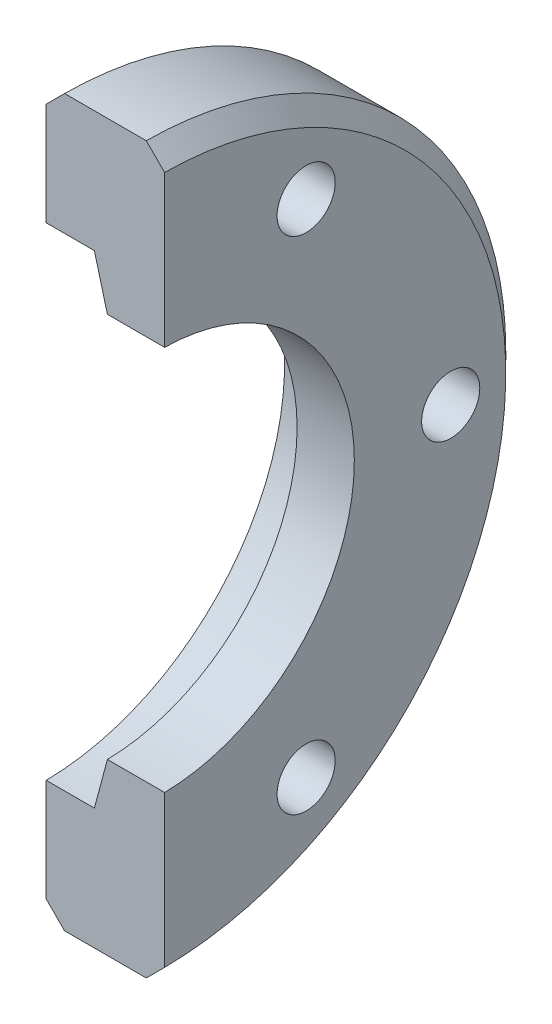
ISO-10303-21;
HEADER;
FILE_DESCRIPTION(('STEP AP214'),'2;1');
FILE_NAME('part.step','',(''),(''),'','','');
FILE_SCHEMA(('AUTOMOTIVE_DESIGN { 1 0 10303 214 1 1 1 1 }'));
ENDSEC;
DATA;
#1=APPLICATION_CONTEXT('core data for automotive mechanical design processes');
#2=APPLICATION_PROTOCOL_DEFINITION('international standard','automotive_design',2000,#1);
#3=PRODUCT_CONTEXT('',#1,'mechanical');
#4=PRODUCT('Part','Part','',(#3));
#5=PRODUCT_RELATED_PRODUCT_CATEGORY('part','',(#4));
#6=PRODUCT_DEFINITION_FORMATION('','',#4);
#7=PRODUCT_DEFINITION_CONTEXT('part definition',#1,'design');
#8=PRODUCT_DEFINITION('design','',#6,#7);
#9=PRODUCT_DEFINITION_SHAPE('','',#8);
#10=(LENGTH_UNIT() NAMED_UNIT(*) SI_UNIT(.MILLI.,.METRE.));
#11=(NAMED_UNIT(*) PLANE_ANGLE_UNIT() SI_UNIT($,.RADIAN.));
#12=(NAMED_UNIT(*) SI_UNIT($,.STERADIAN.) SOLID_ANGLE_UNIT());
#13=UNCERTAINTY_MEASURE_WITH_UNIT(LENGTH_MEASURE(1.E-05),#10,'distance_accuracy_value','');
#14=(GEOMETRIC_REPRESENTATION_CONTEXT(3) GLOBAL_UNCERTAINTY_ASSIGNED_CONTEXT((#13)) GLOBAL_UNIT_ASSIGNED_CONTEXT((#10,
#11,#12)) REPRESENTATION_CONTEXT('',''));
#15=CARTESIAN_POINT('',(0.,0.,0.));
#16=DIRECTION('',(0.,0.,1.));
#17=DIRECTION('',(1.,0.,0.));
#18=AXIS2_PLACEMENT_3D('',#15,#16,#17);
#19=CARTESIAN_POINT('',(0.,20.7872077670378,-12.0015));
#20=DIRECTION('',(1.,0.,0.));
#21=DIRECTION('',(0.,0.,-1.));
#22=AXIS2_PLACEMENT_3D('',#19,#20,#21);
#23=CYLINDRICAL_SURFACE('',#22,2.413);
#24=CARTESIAN_POINT('',(9.8298,20.7872077670378,-12.0015));
#25=DIRECTION('',(-1.,0.,0.));
#26=DIRECTION('',(0.,0.,-1.));
#27=AXIS2_PLACEMENT_3D('',#24,#25,#26);
#28=CIRCLE('',#27,2.413);
#29=CARTESIAN_POINT('',(9.8298,20.7872077670378,-14.4145));
#30=VERTEX_POINT('',#29);
#31=EDGE_CURVE('E147',#30,#30,#28,.T.);
#32=ORIENTED_EDGE('',*,*,#31,.F.);
#33=EDGE_LOOP('',(#32));
#34=FACE_BOUND('',#33,.T.);
#35=CARTESIAN_POINT('',(0.,20.7872077670378,-12.0015));
#36=DIRECTION('',(1.,0.,0.));
#37=DIRECTION('',(0.,0.,-1.));
#38=AXIS2_PLACEMENT_3D('',#35,#36,#37);
#39=CIRCLE('',#38,2.413);
#40=CARTESIAN_POINT('',(0.,20.7872077670378,-14.4145));
#41=VERTEX_POINT('',#40);
#42=EDGE_CURVE('E114',#41,#41,#39,.T.);
#43=ORIENTED_EDGE('',*,*,#42,.F.);
#44=EDGE_LOOP('',(#43));
#45=FACE_BOUND('',#44,.T.);
#46=ADVANCED_FACE('F16',(#34,#45),#23,.F.);
#47=CARTESIAN_POINT('',(9.8298,22.2885,0.));
#48=DIRECTION('',(1.,0.,0.));
#49=DIRECTION('',(0.,1.,0.));
#50=AXIS2_PLACEMENT_3D('',#47,#48,#49);
#51=PLANE('',#50);
#52=DIRECTION('',(0.,-1.,0.));
#53=VECTOR('',#52,1.);
#54=CARTESIAN_POINT('',(9.8298,11.14425,-0.254));
#55=LINE('',#54,#53);
#56=CARTESIAN_POINT('',(9.8298,-15.999983999992,-0.254));
#57=VERTEX_POINT('',#56);
#58=CARTESIAN_POINT('',(9.8298,-28.5738710888113,-0.254));
#59=VERTEX_POINT('',#58);
#60=EDGE_CURVE('E11',#57,#59,#55,.T.);
#61=ORIENTED_EDGE('',*,*,#60,.T.);
#62=CARTESIAN_POINT('',(9.8298,0.,0.));
#63=DIRECTION('',(-1.,0.,0.));
#64=DIRECTION('',(0.,1.,0.));
#65=AXIS2_PLACEMENT_3D('',#62,#63,#64);
#66=CIRCLE('',#65,28.575);
#67=CARTESIAN_POINT('',(9.8298,28.5738710888113,-0.254));
#68=VERTEX_POINT('',#67);
#69=EDGE_CURVE('E35',#68,#59,#66,.T.);
#70=ORIENTED_EDGE('',*,*,#69,.F.);
#71=DIRECTION('',(0.,-1.,0.));
#72=VECTOR('',#71,1.);
#73=CARTESIAN_POINT('',(9.8298,11.14425,-0.254));
#74=LINE('',#73,#72);
#75=CARTESIAN_POINT('',(9.8298,15.999983999992,-0.254));
#76=VERTEX_POINT('',#75);
#77=EDGE_CURVE('E26',#68,#76,#74,.T.);
#78=ORIENTED_EDGE('',*,*,#77,.T.);
#79=CARTESIAN_POINT('',(9.8298,0.,0.));
#80=DIRECTION('',(-1.,0.,0.));
#81=DIRECTION('',(0.,1.,0.));
#82=AXIS2_PLACEMENT_3D('',#79,#80,#81);
#83=CIRCLE('',#82,16.002);
#84=EDGE_CURVE('E154',#76,#57,#83,.T.);
#85=ORIENTED_EDGE('',*,*,#84,.T.);
#86=EDGE_LOOP('',(#61,#70,#78,#85));
#87=FACE_BOUND('',#86,.T.);
#88=CARTESIAN_POINT('',(9.8298,-20.7872077670379,-12.0015));
#89=DIRECTION('',(-1.,0.,0.));
#90=DIRECTION('',(0.,0.,-1.));
#91=AXIS2_PLACEMENT_3D('',#88,#89,#90);
#92=CIRCLE('',#91,2.413);
#93=CARTESIAN_POINT('',(9.8298,-20.7872077670379,-14.4145));
#94=VERTEX_POINT('',#93);
#95=EDGE_CURVE('E151',#94,#94,#92,.T.);
#96=ORIENTED_EDGE('',*,*,#95,.T.);
#97=EDGE_LOOP('',(#96));
#98=FACE_BOUND('',#97,.T.);
#99=CARTESIAN_POINT('',(9.8298,0.,-24.003));
#100=DIRECTION('',(-1.,0.,0.));
#101=DIRECTION('',(0.,0.,-1.));
#102=AXIS2_PLACEMENT_3D('',#99,#100,#101);
#103=CIRCLE('',#102,2.413);
#104=CARTESIAN_POINT('',(9.8298,0.,-26.416));
#105=VERTEX_POINT('',#104);
#106=EDGE_CURVE('E148',#105,#105,#103,.T.);
#107=ORIENTED_EDGE('',*,*,#106,.T.);
#108=EDGE_LOOP('',(#107));
#109=FACE_BOUND('',#108,.T.);
#110=ORIENTED_EDGE('',*,*,#31,.T.);
#111=EDGE_LOOP('',(#110));
#112=FACE_BOUND('',#111,.T.);
#113=ADVANCED_FACE('F163',(#87,#98,#109,#112),#51,.T.);
#114=CARTESIAN_POINT('',(7.4549,0.,0.));
#115=DIRECTION('',(-1.,0.,0.));
#116=DIRECTION('',(0.,1.,0.));
#117=AXIS2_PLACEMENT_3D('',#114,#115,#116);
#118=CYLINDRICAL_SURFACE('',#117,16.002);
#119=DIRECTION('',(1.,0.,0.));
#120=VECTOR('',#119,1.);
#121=CARTESIAN_POINT('',(7.4549,-15.999983999992,-0.254));
#122=LINE('',#121,#120);
#123=CARTESIAN_POINT('',(5.08,-15.999983999992,-0.254));
#124=VERTEX_POINT('',#123);
#125=EDGE_CURVE('E144',#124,#57,#122,.T.);
#126=ORIENTED_EDGE('',*,*,#125,.T.);
#127=ORIENTED_EDGE('',*,*,#84,.F.);
#128=DIRECTION('',(-1.,0.,0.));
#129=VECTOR('',#128,1.);
#130=CARTESIAN_POINT('',(7.4549,15.999983999992,-0.254));
#131=LINE('',#130,#129);
#132=CARTESIAN_POINT('',(5.08,15.999983999992,-0.254));
#133=VERTEX_POINT('',#132);
#134=EDGE_CURVE('E141',#76,#133,#131,.T.);
#135=ORIENTED_EDGE('',*,*,#134,.T.);
#136=CARTESIAN_POINT('',(5.08,0.,0.));
#137=DIRECTION('',(-1.,0.,0.));
#138=DIRECTION('',(0.,1.,0.));
#139=AXIS2_PLACEMENT_3D('',#136,#137,#138);
#140=CIRCLE('',#139,16.002);
#141=EDGE_CURVE('E139',#133,#124,#140,.T.);
#142=ORIENTED_EDGE('',*,*,#141,.T.);
#143=EDGE_LOOP('',(#126,#127,#135,#142));
#144=FACE_BOUND('',#143,.T.);
#145=ADVANCED_FACE('F210',(#144),#118,.F.);
#146=CARTESIAN_POINT('',(4.53893019572384,0.,0.));
#147=DIRECTION('',(-1.,0.,0.));
#148=DIRECTION('',(0.,1.,0.));
#149=AXIS2_PLACEMENT_3D('',#146,#147,#148);
#150=CONICAL_SURFACE('',#149,18.0213,1.30899693899575);
#151=DIRECTION('',(0.258794753085111,0.965932334988128,0.));
#152=VECTOR('',#151,1.);
#153=CARTESIAN_POINT('',(4.53893019572384,-18.0194871514495,-0.254));
#154=LINE('',#153,#152);
#155=CARTESIAN_POINT('',(3.99786039144766,-20.038990302907,-0.254));
#156=VERTEX_POINT('',#155);
#157=EDGE_CURVE('E136',#156,#124,#154,.T.);
#158=ORIENTED_EDGE('',*,*,#157,.T.);
#159=ORIENTED_EDGE('',*,*,#141,.F.);
#160=DIRECTION('',(-0.258794753085111,0.965932334988128,0.));
#161=VECTOR('',#160,1.);
#162=CARTESIAN_POINT('',(4.53893019572384,18.0194871514495,-0.254));
#163=LINE('',#162,#161);
#164=CARTESIAN_POINT('',(3.99786039144766,20.038990302907,-0.254));
#165=VERTEX_POINT('',#164);
#166=EDGE_CURVE('E133',#133,#165,#163,.T.);
#167=ORIENTED_EDGE('',*,*,#166,.T.);
#168=CARTESIAN_POINT('',(3.99786039144766,0.,0.));
#169=DIRECTION('',(-1.,0.,0.));
#170=DIRECTION('',(0.,1.,0.));
#171=AXIS2_PLACEMENT_3D('',#168,#169,#170);
#172=CIRCLE('',#171,20.0406);
#173=EDGE_CURVE('E131',#165,#156,#172,.T.);
#174=ORIENTED_EDGE('',*,*,#173,.T.);
#175=EDGE_LOOP('',(#158,#159,#167,#174));
#176=FACE_BOUND('',#175,.T.);
#177=ADVANCED_FACE('F206',(#176),#150,.F.);
#178=CARTESIAN_POINT('',(1.99893019572384,0.,0.));
#179=DIRECTION('',(-1.,0.,0.));
#180=DIRECTION('',(0.,1.,0.));
#181=AXIS2_PLACEMENT_3D('',#178,#179,#180);
#182=CYLINDRICAL_SURFACE('',#181,20.0406);
#183=DIRECTION('',(1.,0.,0.));
#184=VECTOR('',#183,1.);
#185=CARTESIAN_POINT('',(1.99893019572384,-20.038990302907,-0.254));
#186=LINE('',#185,#184);
#187=CARTESIAN_POINT('',(0.,-20.038990302907,-0.254));
#188=VERTEX_POINT('',#187);
#189=EDGE_CURVE('E128',#188,#156,#186,.T.);
#190=ORIENTED_EDGE('',*,*,#189,.T.);
#191=ORIENTED_EDGE('',*,*,#173,.F.);
#192=DIRECTION('',(-1.,0.,0.));
#193=VECTOR('',#192,1.);
#194=CARTESIAN_POINT('',(1.99893019572384,20.038990302907,-0.254));
#195=LINE('',#194,#193);
#196=CARTESIAN_POINT('',(0.,20.038990302907,-0.254));
#197=VERTEX_POINT('',#196);
#198=EDGE_CURVE('E125',#165,#197,#195,.T.);
#199=ORIENTED_EDGE('',*,*,#198,.T.);
#200=CARTESIAN_POINT('',(0.,0.,0.));
#201=DIRECTION('',(-1.,0.,0.));
#202=DIRECTION('',(0.,1.,0.));
#203=AXIS2_PLACEMENT_3D('',#200,#201,#202);
#204=CIRCLE('',#203,20.0406);
#205=EDGE_CURVE('E123',#197,#188,#204,.T.);
#206=ORIENTED_EDGE('',*,*,#205,.T.);
#207=EDGE_LOOP('',(#190,#191,#199,#206));
#208=FACE_BOUND('',#207,.T.);
#209=ADVANCED_FACE('F174',(#208),#182,.F.);
#210=CARTESIAN_POINT('',(0.,24.3078,0.));
#211=DIRECTION('',(-1.,0.,0.));
#212=DIRECTION('',(0.,0.,1.));
#213=AXIS2_PLACEMENT_3D('',#210,#211,#212);
#214=PLANE('',#213);
#215=DIRECTION('',(0.,1.,0.));
#216=VECTOR('',#215,1.);
#217=CARTESIAN_POINT('',(0.,12.1539,-0.254));
#218=LINE('',#217,#216);
#219=CARTESIAN_POINT('',(0.,-28.5738710888113,-0.254));
#220=VERTEX_POINT('',#219);
#221=EDGE_CURVE('E120',#220,#188,#218,.T.);
#222=ORIENTED_EDGE('',*,*,#221,.T.);
#223=ORIENTED_EDGE('',*,*,#205,.F.);
#224=DIRECTION('',(0.,1.,0.));
#225=VECTOR('',#224,1.);
#226=CARTESIAN_POINT('',(0.,12.1539,-0.254));
#227=LINE('',#226,#225);
#228=CARTESIAN_POINT('',(0.,28.5738710888113,-0.254));
#229=VERTEX_POINT('',#228);
#230=EDGE_CURVE('E117',#197,#229,#227,.T.);
#231=ORIENTED_EDGE('',*,*,#230,.T.);
#232=CARTESIAN_POINT('',(0.,0.,0.));
#233=DIRECTION('',(-1.,0.,0.));
#234=DIRECTION('',(0.,1.,0.));
#235=AXIS2_PLACEMENT_3D('',#232,#233,#234);
#236=CIRCLE('',#235,28.575);
#237=EDGE_CURVE('E115',#229,#220,#236,.T.);
#238=ORIENTED_EDGE('',*,*,#237,.T.);
#239=EDGE_LOOP('',(#222,#223,#231,#238));
#240=FACE_BOUND('',#239,.T.);
#241=ORIENTED_EDGE('',*,*,#42,.T.);
#242=EDGE_LOOP('',(#241));
#243=FACE_BOUND('',#242,.T.);
#244=CARTESIAN_POINT('',(0.,0.,-24.003));
#245=DIRECTION('',(1.,0.,0.));
#246=DIRECTION('',(0.,0.,-1.));
#247=AXIS2_PLACEMENT_3D('',#244,#245,#246);
#248=CIRCLE('',#247,2.413);
#249=CARTESIAN_POINT('',(0.,0.,-26.416));
#250=VERTEX_POINT('',#249);
#251=EDGE_CURVE('E111',#250,#250,#248,.T.);
#252=ORIENTED_EDGE('',*,*,#251,.T.);
#253=EDGE_LOOP('',(#252));
#254=FACE_BOUND('',#253,.T.);
#255=CARTESIAN_POINT('',(0.,-20.7872077670379,-12.0015));
#256=DIRECTION('',(1.,0.,0.));
#257=DIRECTION('',(0.,0.,-1.));
#258=AXIS2_PLACEMENT_3D('',#255,#256,#257);
#259=CIRCLE('',#258,2.413);
#260=CARTESIAN_POINT('',(0.,-20.7872077670379,-14.4145));
#261=VERTEX_POINT('',#260);
#262=EDGE_CURVE('E108',#261,#261,#259,.T.);
#263=ORIENTED_EDGE('',*,*,#262,.T.);
#264=EDGE_LOOP('',(#263));
#265=FACE_BOUND('',#264,.T.);
#266=ADVANCED_FACE('F170',(#240,#243,#254,#265),#214,.T.);
#267=CARTESIAN_POINT('',(0.762,0.,0.));
#268=DIRECTION('',(1.,0.,0.));
#269=DIRECTION('',(0.,1.,0.));
#270=AXIS2_PLACEMENT_3D('',#267,#268,#269);
#271=CONICAL_SURFACE('',#270,29.337,0.785398163397449);
#272=DIRECTION('',(-0.707093520240099,0.707120041884308,0.));
#273=VECTOR('',#272,1.);
#274=CARTESIAN_POINT('',(0.762,-29.3358996698862,-0.254));
#275=LINE('',#274,#273);
#276=CARTESIAN_POINT('',(1.524,-30.0979282509611,-0.254));
#277=VERTEX_POINT('',#276);
#278=EDGE_CURVE('E105',#277,#220,#275,.T.);
#279=ORIENTED_EDGE('',*,*,#278,.T.);
#280=ORIENTED_EDGE('',*,*,#237,.F.);
#281=DIRECTION('',(0.707093520240099,0.707120041884308,0.));
#282=VECTOR('',#281,1.);
#283=CARTESIAN_POINT('',(0.762,29.3358996698862,-0.254));
#284=LINE('',#283,#282);
#285=CARTESIAN_POINT('',(1.524,30.0979282509611,-0.254));
#286=VERTEX_POINT('',#285);
#287=EDGE_CURVE('E103',#229,#286,#284,.T.);
#288=ORIENTED_EDGE('',*,*,#287,.T.);
#289=CARTESIAN_POINT('',(1.524,0.,0.));
#290=DIRECTION('',(-1.,0.,0.));
#291=DIRECTION('',(0.,1.,0.));
#292=AXIS2_PLACEMENT_3D('',#289,#290,#291);
#293=CIRCLE('',#292,30.099);
#294=EDGE_CURVE('E96',#286,#277,#293,.T.);
#295=ORIENTED_EDGE('',*,*,#294,.T.);
#296=EDGE_LOOP('',(#279,#280,#288,#295));
#297=FACE_BOUND('',#296,.T.);
#298=ADVANCED_FACE('F173',(#297),#271,.T.);
#299=CARTESIAN_POINT('',(9.0678,0.,0.));
#300=DIRECTION('',(-1.,0.,0.));
#301=DIRECTION('',(0.,1.,0.));
#302=AXIS2_PLACEMENT_3D('',#299,#300,#301);
#303=CONICAL_SURFACE('',#302,29.337,0.785398163397449);
#304=DIRECTION('',(-0.707093520240097,-0.707120041884309,0.));
#305=VECTOR('',#304,1.);
#306=CARTESIAN_POINT('',(9.0678,-29.3358996698862,-0.254));
#307=LINE('',#306,#305);
#308=CARTESIAN_POINT('',(8.3058,-30.0979282509611,-0.254));
#309=VERTEX_POINT('',#308);
#310=EDGE_CURVE('E83',#59,#309,#307,.T.);
#311=ORIENTED_EDGE('',*,*,#310,.T.);
#312=CARTESIAN_POINT('',(8.3058,0.,0.));
#313=DIRECTION('',(-1.,0.,0.));
#314=DIRECTION('',(0.,1.,0.));
#315=AXIS2_PLACEMENT_3D('',#312,#313,#314);
#316=CIRCLE('',#315,30.099);
#317=CARTESIAN_POINT('',(8.3058,30.0979282509611,-0.254));
#318=VERTEX_POINT('',#317);
#319=EDGE_CURVE('E78',#318,#309,#316,.T.);
#320=ORIENTED_EDGE('',*,*,#319,.F.);
#321=DIRECTION('',(0.707093520240097,-0.707120041884309,0.));
#322=VECTOR('',#321,1.);
#323=CARTESIAN_POINT('',(9.0678,29.3358996698862,-0.254));
#324=LINE('',#323,#322);
#325=EDGE_CURVE('E81',#318,#68,#324,.T.);
#326=ORIENTED_EDGE('',*,*,#325,.T.);
#327=ORIENTED_EDGE('',*,*,#69,.T.);
#328=EDGE_LOOP('',(#311,#320,#326,#327));
#329=FACE_BOUND('',#328,.T.);
#330=ADVANCED_FACE('F80',(#329),#303,.T.);
#331=CARTESIAN_POINT('',(4.9149,0.,0.));
#332=DIRECTION('',(-1.,0.,0.));
#333=DIRECTION('',(0.,1.,0.));
#334=AXIS2_PLACEMENT_3D('',#331,#332,#333);
#335=CYLINDRICAL_SURFACE('',#334,30.099);
#336=DIRECTION('',(-1.,0.,0.));
#337=VECTOR('',#336,1.);
#338=CARTESIAN_POINT('',(4.9149,-30.0979282509611,-0.254));
#339=LINE('',#338,#337);
#340=EDGE_CURVE('E98',#309,#277,#339,.T.);
#341=ORIENTED_EDGE('',*,*,#340,.T.);
#342=ORIENTED_EDGE('',*,*,#294,.F.);
#343=DIRECTION('',(1.,0.,0.));
#344=VECTOR('',#343,1.);
#345=CARTESIAN_POINT('',(4.9149,30.0979282509611,-0.254));
#346=LINE('',#345,#344);
#347=EDGE_CURVE('E20',#286,#318,#346,.T.);
#348=ORIENTED_EDGE('',*,*,#347,.T.);
#349=ORIENTED_EDGE('',*,*,#319,.T.);
#350=EDGE_LOOP('',(#341,#342,#348,#349));
#351=FACE_BOUND('',#350,.T.);
#352=ADVANCED_FACE('F95',(#351),#335,.T.);
#353=CARTESIAN_POINT('',(0.,0.,-0.254));
#354=DIRECTION('',(0.,0.,1.));
#355=DIRECTION('',(1.,0.,0.));
#356=AXIS2_PLACEMENT_3D('',#353,#354,#355);
#357=PLANE('',#356);
#358=ORIENTED_EDGE('',*,*,#189,.F.);
#359=ORIENTED_EDGE('',*,*,#221,.F.);
#360=ORIENTED_EDGE('',*,*,#278,.F.);
#361=ORIENTED_EDGE('',*,*,#340,.F.);
#362=ORIENTED_EDGE('',*,*,#310,.F.);
#363=ORIENTED_EDGE('',*,*,#60,.F.);
#364=ORIENTED_EDGE('',*,*,#125,.F.);
#365=ORIENTED_EDGE('',*,*,#157,.F.);
#366=EDGE_LOOP('',(#358,#359,#360,#361,#362,#363,#364,#365));
#367=FACE_BOUND('',#366,.T.);
#368=ADVANCED_FACE('F190',(#367),#357,.T.);
#369=CARTESIAN_POINT('',(0.,0.,-0.254));
#370=DIRECTION('',(0.,0.,1.));
#371=DIRECTION('',(1.,0.,0.));
#372=AXIS2_PLACEMENT_3D('',#369,#370,#371);
#373=PLANE('',#372);
#374=ORIENTED_EDGE('',*,*,#198,.F.);
#375=ORIENTED_EDGE('',*,*,#166,.F.);
#376=ORIENTED_EDGE('',*,*,#134,.F.);
#377=ORIENTED_EDGE('',*,*,#77,.F.);
#378=ORIENTED_EDGE('',*,*,#325,.F.);
#379=ORIENTED_EDGE('',*,*,#347,.F.);
#380=ORIENTED_EDGE('',*,*,#287,.F.);
#381=ORIENTED_EDGE('',*,*,#230,.F.);
#382=EDGE_LOOP('',(#374,#375,#376,#377,#378,#379,#380,#381));
#383=FACE_BOUND('',#382,.T.);
#384=ADVANCED_FACE('F90',(#383),#373,.T.);
#385=CARTESIAN_POINT('',(0.,-20.7872077670379,-12.0015));
#386=DIRECTION('',(1.,0.,0.));
#387=DIRECTION('',(0.,0.,-1.));
#388=AXIS2_PLACEMENT_3D('',#385,#386,#387);
#389=CYLINDRICAL_SURFACE('',#388,2.413);
#390=ORIENTED_EDGE('',*,*,#95,.F.);
#391=EDGE_LOOP('',(#390));
#392=FACE_BOUND('',#391,.T.);
#393=ORIENTED_EDGE('',*,*,#262,.F.);
#394=EDGE_LOOP('',(#393));
#395=FACE_BOUND('',#394,.T.);
#396=ADVANCED_FACE('F181',(#392,#395),#389,.F.);
#397=CARTESIAN_POINT('',(0.,0.,-24.003));
#398=DIRECTION('',(1.,0.,0.));
#399=DIRECTION('',(0.,0.,-1.));
#400=AXIS2_PLACEMENT_3D('',#397,#398,#399);
#401=CYLINDRICAL_SURFACE('',#400,2.413);
#402=ORIENTED_EDGE('',*,*,#106,.F.);
#403=EDGE_LOOP('',(#402));
#404=FACE_BOUND('',#403,.T.);
#405=ORIENTED_EDGE('',*,*,#251,.F.);
#406=EDGE_LOOP('',(#405));
#407=FACE_BOUND('',#406,.T.);
#408=ADVANCED_FACE('F18',(#404,#407),#401,.F.);
#409=CLOSED_SHELL('',(#46,#113,#145,#177,#209,#266,#298,#330,#352,#368,#384,#396,#408));
#410=MANIFOLD_SOLID_BREP('B1',#409);
#411=ADVANCED_BREP_SHAPE_REPRESENTATION('',(#18,#410),#14);
#412=SHAPE_DEFINITION_REPRESENTATION(#9,#411);
ENDSEC;
END-ISO-10303-21;
